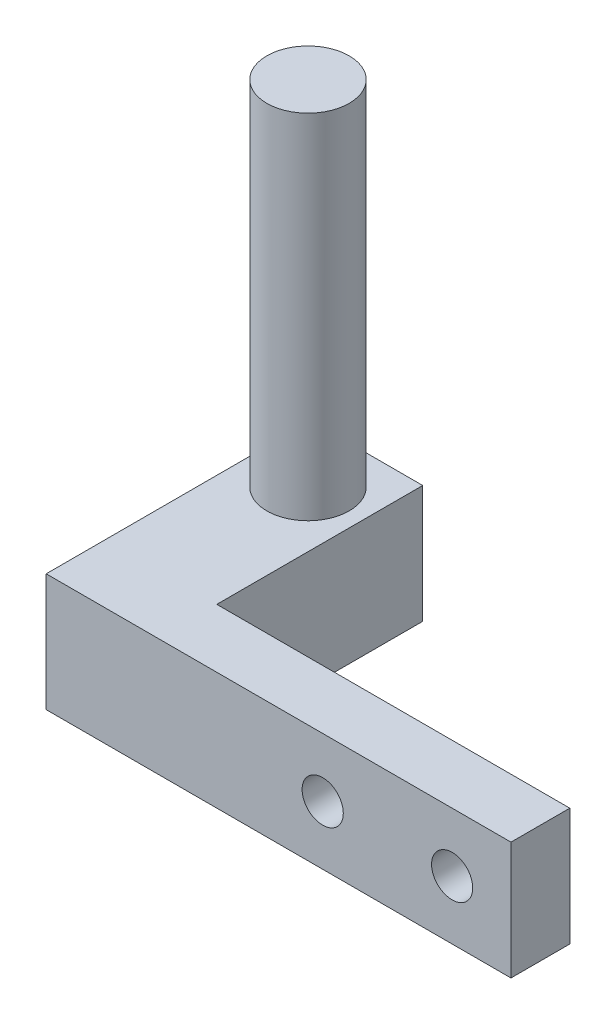
ISO-10303-21;
HEADER;
FILE_DESCRIPTION(('STEP AP214'),'2;1');
FILE_NAME('part.step','',(''),(''),'','','');
FILE_SCHEMA(('AUTOMOTIVE_DESIGN { 1 0 10303 214 1 1 1 1 }'));
ENDSEC;
DATA;
#1=APPLICATION_CONTEXT('core data for automotive mechanical design processes');
#2=APPLICATION_PROTOCOL_DEFINITION('international standard','automotive_design',2000,#1);
#3=PRODUCT_CONTEXT('',#1,'mechanical');
#4=PRODUCT('Part','Part','',(#3));
#5=PRODUCT_RELATED_PRODUCT_CATEGORY('part','',(#4));
#6=PRODUCT_DEFINITION_FORMATION('','',#4);
#7=PRODUCT_DEFINITION_CONTEXT('part definition',#1,'design');
#8=PRODUCT_DEFINITION('design','',#6,#7);
#9=PRODUCT_DEFINITION_SHAPE('','',#8);
#10=(LENGTH_UNIT() NAMED_UNIT(*) SI_UNIT(.MILLI.,.METRE.));
#11=(NAMED_UNIT(*) PLANE_ANGLE_UNIT() SI_UNIT($,.RADIAN.));
#12=(NAMED_UNIT(*) SI_UNIT($,.STERADIAN.) SOLID_ANGLE_UNIT());
#13=UNCERTAINTY_MEASURE_WITH_UNIT(LENGTH_MEASURE(1.E-05),#10,'distance_accuracy_value','');
#14=(GEOMETRIC_REPRESENTATION_CONTEXT(3) GLOBAL_UNCERTAINTY_ASSIGNED_CONTEXT((#13)) GLOBAL_UNIT_ASSIGNED_CONTEXT((#10,
#11,#12)) REPRESENTATION_CONTEXT('',''));
#15=CARTESIAN_POINT('',(0.,0.,0.));
#16=DIRECTION('',(0.,0.,1.));
#17=DIRECTION('',(1.,0.,0.));
#18=AXIS2_PLACEMENT_3D('',#15,#16,#17);
#19=CARTESIAN_POINT('',(8.5,0.,0.));
#20=DIRECTION('',(-1.,0.,0.));
#21=DIRECTION('',(0.,0.,1.));
#22=AXIS2_PLACEMENT_3D('',#19,#20,#21);
#23=PLANE('',#22);
#24=DIRECTION('',(0.,1.,0.));
#25=VECTOR('',#24,1.);
#26=CARTESIAN_POINT('',(8.5,0.,17.5));
#27=LINE('',#26,#25);
#28=CARTESIAN_POINT('',(8.5,0.,17.5));
#29=VERTEX_POINT('',#28);
#30=CARTESIAN_POINT('',(8.5,10.,17.5));
#31=VERTEX_POINT('',#30);
#32=EDGE_CURVE('E51',#29,#31,#27,.T.);
#33=ORIENTED_EDGE('',*,*,#32,.F.);
#34=DIRECTION('',(0.,0.,1.));
#35=VECTOR('',#34,1.);
#36=CARTESIAN_POINT('',(8.5,0.,0.));
#37=LINE('',#36,#35);
#38=CARTESIAN_POINT('',(8.5,0.,0.));
#39=VERTEX_POINT('',#38);
#40=EDGE_CURVE('E135',#39,#29,#37,.T.);
#41=ORIENTED_EDGE('',*,*,#40,.F.);
#42=DIRECTION('',(0.,1.,0.));
#43=VECTOR('',#42,1.);
#44=CARTESIAN_POINT('',(8.5,0.,0.));
#45=LINE('',#44,#43);
#46=CARTESIAN_POINT('',(8.5,10.,0.));
#47=VERTEX_POINT('',#46);
#48=EDGE_CURVE('E137',#39,#47,#45,.T.);
#49=ORIENTED_EDGE('',*,*,#48,.T.);
#50=DIRECTION('',(0.,0.,1.));
#51=VECTOR('',#50,1.);
#52=CARTESIAN_POINT('',(8.5,10.,0.));
#53=LINE('',#52,#51);
#54=EDGE_CURVE('E134',#47,#31,#53,.T.);
#55=ORIENTED_EDGE('',*,*,#54,.T.);
#56=EDGE_LOOP('',(#33,#41,#49,#55));
#57=FACE_BOUND('',#56,.T.);
#58=ADVANCED_FACE('F34',(#57),#23,.F.);
#59=CARTESIAN_POINT('',(0.,0.,10.));
#60=DIRECTION('',(0.,1.,0.));
#61=DIRECTION('',(0.,0.,1.));
#62=AXIS2_PLACEMENT_3D('',#59,#60,#61);
#63=PLANE('',#62);
#64=ORIENTED_EDGE('',*,*,#40,.T.);
#65=DIRECTION('',(-1.,0.,0.));
#66=VECTOR('',#65,1.);
#67=CARTESIAN_POINT('',(38.5,0.,17.5));
#68=LINE('',#67,#66);
#69=CARTESIAN_POINT('',(38.5,0.,17.5));
#70=VERTEX_POINT('',#69);
#71=EDGE_CURVE('E104',#70,#29,#68,.T.);
#72=ORIENTED_EDGE('',*,*,#71,.F.);
#73=DIRECTION('',(0.,0.,-1.));
#74=VECTOR('',#73,1.);
#75=CARTESIAN_POINT('',(38.5,0.,22.5));
#76=LINE('',#75,#74);
#77=CARTESIAN_POINT('',(38.5,0.,22.5));
#78=VERTEX_POINT('',#77);
#79=EDGE_CURVE('E102',#78,#70,#76,.T.);
#80=ORIENTED_EDGE('',*,*,#79,.F.);
#81=DIRECTION('',(1.,0.,0.));
#82=VECTOR('',#81,1.);
#83=CARTESIAN_POINT('',(8.5,0.,22.5));
#84=LINE('',#83,#82);
#85=CARTESIAN_POINT('',(-1.,0.,22.5));
#86=VERTEX_POINT('',#85);
#87=EDGE_CURVE('E91',#86,#78,#84,.T.);
#88=ORIENTED_EDGE('',*,*,#87,.F.);
#89=DIRECTION('',(0.,0.,-1.));
#90=VECTOR('',#89,1.);
#91=CARTESIAN_POINT('',(-1.,0.,0.));
#92=LINE('',#91,#90);
#93=CARTESIAN_POINT('',(-1.,0.,0.));
#94=VERTEX_POINT('',#93);
#95=EDGE_CURVE('E129',#86,#94,#92,.T.);
#96=ORIENTED_EDGE('',*,*,#95,.T.);
#97=DIRECTION('',(1.,0.,0.));
#98=VECTOR('',#97,1.);
#99=CARTESIAN_POINT('',(0.,0.,0.));
#100=LINE('',#99,#98);
#101=EDGE_CURVE('E143',#94,#39,#100,.T.);
#102=ORIENTED_EDGE('',*,*,#101,.T.);
#103=EDGE_LOOP('',(#64,#72,#80,#88,#96,#102));
#104=FACE_BOUND('',#103,.T.);
#105=ADVANCED_FACE('F36',(#104),#63,.F.);
#106=CARTESIAN_POINT('',(0.,10.,10.));
#107=DIRECTION('',(0.,-1.,0.));
#108=DIRECTION('',(0.,0.,-1.));
#109=AXIS2_PLACEMENT_3D('',#106,#107,#108);
#110=PLANE('',#109);
#111=CARTESIAN_POINT('',(3.75,10.,5.));
#112=DIRECTION('',(0.,-1.,0.));
#113=DIRECTION('',(0.,0.,-1.));
#114=AXIS2_PLACEMENT_3D('',#111,#112,#113);
#115=CIRCLE('',#114,3.5);
#116=CARTESIAN_POINT('',(3.75,10.,1.5));
#117=VERTEX_POINT('',#116);
#118=EDGE_CURVE('E11',#117,#117,#115,.F.);
#119=ORIENTED_EDGE('',*,*,#118,.F.);
#120=EDGE_LOOP('',(#119));
#121=FACE_BOUND('',#120,.T.);
#122=DIRECTION('',(-1.,0.,0.));
#123=VECTOR('',#122,1.);
#124=CARTESIAN_POINT('',(0.,10.,0.));
#125=LINE('',#124,#123);
#126=CARTESIAN_POINT('',(-1.,10.,0.));
#127=VERTEX_POINT('',#126);
#128=EDGE_CURVE('E43',#47,#127,#125,.T.);
#129=ORIENTED_EDGE('',*,*,#128,.T.);
#130=DIRECTION('',(0.,0.,-1.));
#131=VECTOR('',#130,1.);
#132=CARTESIAN_POINT('',(-1.,10.,0.));
#133=LINE('',#132,#131);
#134=CARTESIAN_POINT('',(-1.,10.,22.5));
#135=VERTEX_POINT('',#134);
#136=EDGE_CURVE('E59',#135,#127,#133,.T.);
#137=ORIENTED_EDGE('',*,*,#136,.F.);
#138=DIRECTION('',(-1.,0.,0.));
#139=VECTOR('',#138,1.);
#140=CARTESIAN_POINT('',(8.5,10.,22.5));
#141=LINE('',#140,#139);
#142=CARTESIAN_POINT('',(38.5,10.,22.5));
#143=VERTEX_POINT('',#142);
#144=EDGE_CURVE('E126',#143,#135,#141,.T.);
#145=ORIENTED_EDGE('',*,*,#144,.F.);
#146=DIRECTION('',(0.,0.,1.));
#147=VECTOR('',#146,1.);
#148=CARTESIAN_POINT('',(38.5,10.,22.5));
#149=LINE('',#148,#147);
#150=CARTESIAN_POINT('',(38.5,10.,17.5));
#151=VERTEX_POINT('',#150);
#152=EDGE_CURVE('E112',#151,#143,#149,.T.);
#153=ORIENTED_EDGE('',*,*,#152,.F.);
#154=DIRECTION('',(-1.,0.,0.));
#155=VECTOR('',#154,1.);
#156=CARTESIAN_POINT('',(38.5,10.,17.5));
#157=LINE('',#156,#155);
#158=EDGE_CURVE('E121',#151,#31,#157,.T.);
#159=ORIENTED_EDGE('',*,*,#158,.T.);
#160=ORIENTED_EDGE('',*,*,#54,.F.);
#161=EDGE_LOOP('',(#129,#137,#145,#153,#159,#160));
#162=FACE_BOUND('',#161,.T.);
#163=ADVANCED_FACE('F179',(#121,#162),#110,.F.);
#164=CARTESIAN_POINT('',(0.,0.,0.));
#165=DIRECTION('',(0.,0.,-1.));
#166=DIRECTION('',(-1.,0.,0.));
#167=AXIS2_PLACEMENT_3D('',#164,#165,#166);
#168=PLANE('',#167);
#169=DIRECTION('',(0.,1.,0.));
#170=VECTOR('',#169,1.);
#171=CARTESIAN_POINT('',(-1.,0.,0.));
#172=LINE('',#171,#170);
#173=EDGE_CURVE('E131',#94,#127,#172,.T.);
#174=ORIENTED_EDGE('',*,*,#173,.T.);
#175=ORIENTED_EDGE('',*,*,#128,.F.);
#176=ORIENTED_EDGE('',*,*,#48,.F.);
#177=ORIENTED_EDGE('',*,*,#101,.F.);
#178=EDGE_LOOP('',(#174,#175,#176,#177));
#179=FACE_BOUND('',#178,.T.);
#180=ADVANCED_FACE('F187',(#179),#168,.T.);
#181=CARTESIAN_POINT('',(3.75,40.,5.));
#182=DIRECTION('',(0.,-1.,0.));
#183=DIRECTION('',(0.,0.,-1.));
#184=AXIS2_PLACEMENT_3D('',#181,#182,#183);
#185=CYLINDRICAL_SURFACE('',#184,3.5);
#186=CARTESIAN_POINT('',(3.75,40.,5.));
#187=DIRECTION('',(0.,1.,0.));
#188=DIRECTION('',(0.,0.,1.));
#189=AXIS2_PLACEMENT_3D('',#186,#187,#188);
#190=CIRCLE('',#189,3.5);
#191=CARTESIAN_POINT('',(3.75,40.,8.5));
#192=VERTEX_POINT('',#191);
#193=EDGE_CURVE('E140',#192,#192,#190,.T.);
#194=ORIENTED_EDGE('',*,*,#193,.F.);
#195=EDGE_LOOP('',(#194));
#196=FACE_BOUND('',#195,.T.);
#197=ORIENTED_EDGE('',*,*,#118,.T.);
#198=EDGE_LOOP('',(#197));
#199=FACE_BOUND('',#198,.T.);
#200=ADVANCED_FACE('F183',(#196,#199),#185,.T.);
#201=CARTESIAN_POINT('',(3.75,40.,5.));
#202=DIRECTION('',(0.,1.,0.));
#203=DIRECTION('',(0.,0.,1.));
#204=AXIS2_PLACEMENT_3D('',#201,#202,#203);
#205=PLANE('',#204);
#206=ORIENTED_EDGE('',*,*,#193,.T.);
#207=EDGE_LOOP('',(#206));
#208=FACE_BOUND('',#207,.T.);
#209=ADVANCED_FACE('F172',(#208),#205,.T.);
#210=CARTESIAN_POINT('',(-1.,0.,0.));
#211=DIRECTION('',(1.,0.,0.));
#212=DIRECTION('',(0.,0.,-1.));
#213=AXIS2_PLACEMENT_3D('',#210,#211,#212);
#214=PLANE('',#213);
#215=ORIENTED_EDGE('',*,*,#136,.T.);
#216=ORIENTED_EDGE('',*,*,#173,.F.);
#217=ORIENTED_EDGE('',*,*,#95,.F.);
#218=DIRECTION('',(0.,-1.,0.));
#219=VECTOR('',#218,1.);
#220=CARTESIAN_POINT('',(-1.,0.,22.5));
#221=LINE('',#220,#219);
#222=EDGE_CURVE('E97',#135,#86,#221,.T.);
#223=ORIENTED_EDGE('',*,*,#222,.F.);
#224=EDGE_LOOP('',(#215,#216,#217,#223));
#225=FACE_BOUND('',#224,.T.);
#226=ADVANCED_FACE('F165',(#225),#214,.F.);
#227=CARTESIAN_POINT('',(0.,0.,22.5));
#228=DIRECTION('',(0.,0.,1.));
#229=DIRECTION('',(1.,0.,0.));
#230=AXIS2_PLACEMENT_3D('',#227,#228,#229);
#231=PLANE('',#230);
#232=CARTESIAN_POINT('',(33.5,5.,22.5));
#233=DIRECTION('',(0.,0.,1.));
#234=DIRECTION('',(1.,0.,0.));
#235=AXIS2_PLACEMENT_3D('',#232,#233,#234);
#236=CIRCLE('',#235,1.75);
#237=CARTESIAN_POINT('',(35.25,5.,22.5));
#238=VERTEX_POINT('',#237);
#239=EDGE_CURVE('E153',#238,#238,#236,.T.);
#240=ORIENTED_EDGE('',*,*,#239,.F.);
#241=EDGE_LOOP('',(#240));
#242=FACE_BOUND('',#241,.T.);
#243=CARTESIAN_POINT('',(22.5,5.,22.5));
#244=DIRECTION('',(0.,0.,1.));
#245=DIRECTION('',(1.,0.,0.));
#246=AXIS2_PLACEMENT_3D('',#243,#244,#245);
#247=CIRCLE('',#246,1.75);
#248=CARTESIAN_POINT('',(24.25,5.,22.5));
#249=VERTEX_POINT('',#248);
#250=EDGE_CURVE('E117',#249,#249,#247,.T.);
#251=ORIENTED_EDGE('',*,*,#250,.F.);
#252=EDGE_LOOP('',(#251));
#253=FACE_BOUND('',#252,.T.);
#254=ORIENTED_EDGE('',*,*,#87,.T.);
#255=DIRECTION('',(0.,-1.,0.));
#256=VECTOR('',#255,1.);
#257=CARTESIAN_POINT('',(38.5,0.,22.5));
#258=LINE('',#257,#256);
#259=EDGE_CURVE('E96',#143,#78,#258,.T.);
#260=ORIENTED_EDGE('',*,*,#259,.F.);
#261=ORIENTED_EDGE('',*,*,#144,.T.);
#262=ORIENTED_EDGE('',*,*,#222,.T.);
#263=EDGE_LOOP('',(#254,#260,#261,#262));
#264=FACE_BOUND('',#263,.T.);
#265=ADVANCED_FACE('F93',(#242,#253,#264),#231,.T.);
#266=CARTESIAN_POINT('',(38.5,0.,17.5));
#267=DIRECTION('',(0.,0.,1.));
#268=DIRECTION('',(1.,0.,0.));
#269=AXIS2_PLACEMENT_3D('',#266,#267,#268);
#270=PLANE('',#269);
#271=CARTESIAN_POINT('',(33.5,5.,17.5));
#272=DIRECTION('',(0.,0.,1.));
#273=DIRECTION('',(1.,0.,0.));
#274=AXIS2_PLACEMENT_3D('',#271,#272,#273);
#275=CIRCLE('',#274,1.75);
#276=CARTESIAN_POINT('',(35.25,5.,17.5));
#277=VERTEX_POINT('',#276);
#278=EDGE_CURVE('E38',#277,#277,#275,.T.);
#279=ORIENTED_EDGE('',*,*,#278,.T.);
#280=EDGE_LOOP('',(#279));
#281=FACE_BOUND('',#280,.T.);
#282=CARTESIAN_POINT('',(22.5,5.,17.5));
#283=DIRECTION('',(0.,0.,1.));
#284=DIRECTION('',(1.,0.,0.));
#285=AXIS2_PLACEMENT_3D('',#282,#283,#284);
#286=CIRCLE('',#285,1.75);
#287=CARTESIAN_POINT('',(24.25,5.,17.5));
#288=VERTEX_POINT('',#287);
#289=EDGE_CURVE('E114',#288,#288,#286,.T.);
#290=ORIENTED_EDGE('',*,*,#289,.T.);
#291=EDGE_LOOP('',(#290));
#292=FACE_BOUND('',#291,.T.);
#293=ORIENTED_EDGE('',*,*,#32,.T.);
#294=ORIENTED_EDGE('',*,*,#158,.F.);
#295=DIRECTION('',(0.,1.,0.));
#296=VECTOR('',#295,1.);
#297=CARTESIAN_POINT('',(38.5,0.,17.5));
#298=LINE('',#297,#296);
#299=EDGE_CURVE('E107',#70,#151,#298,.T.);
#300=ORIENTED_EDGE('',*,*,#299,.F.);
#301=ORIENTED_EDGE('',*,*,#71,.T.);
#302=EDGE_LOOP('',(#293,#294,#300,#301));
#303=FACE_BOUND('',#302,.T.);
#304=ADVANCED_FACE('F164',(#281,#292,#303),#270,.F.);
#305=CARTESIAN_POINT('',(38.5,0.,0.));
#306=DIRECTION('',(-1.,0.,0.));
#307=DIRECTION('',(0.,0.,1.));
#308=AXIS2_PLACEMENT_3D('',#305,#306,#307);
#309=PLANE('',#308);
#310=ORIENTED_EDGE('',*,*,#259,.T.);
#311=ORIENTED_EDGE('',*,*,#79,.T.);
#312=ORIENTED_EDGE('',*,*,#299,.T.);
#313=ORIENTED_EDGE('',*,*,#152,.T.);
#314=EDGE_LOOP('',(#310,#311,#312,#313));
#315=FACE_BOUND('',#314,.T.);
#316=ADVANCED_FACE('F110',(#315),#309,.F.);
#317=CARTESIAN_POINT('',(22.5,5.,0.));
#318=DIRECTION('',(0.,0.,1.));
#319=DIRECTION('',(1.,0.,0.));
#320=AXIS2_PLACEMENT_3D('',#317,#318,#319);
#321=CYLINDRICAL_SURFACE('',#320,1.75);
#322=ORIENTED_EDGE('',*,*,#250,.T.);
#323=EDGE_LOOP('',(#322));
#324=FACE_BOUND('',#323,.T.);
#325=ORIENTED_EDGE('',*,*,#289,.F.);
#326=EDGE_LOOP('',(#325));
#327=FACE_BOUND('',#326,.T.);
#328=ADVANCED_FACE('F265',(#324,#327),#321,.F.);
#329=CARTESIAN_POINT('',(33.5,5.,0.));
#330=DIRECTION('',(0.,0.,1.));
#331=DIRECTION('',(1.,0.,0.));
#332=AXIS2_PLACEMENT_3D('',#329,#330,#331);
#333=CYLINDRICAL_SURFACE('',#332,1.75);
#334=ORIENTED_EDGE('',*,*,#239,.T.);
#335=EDGE_LOOP('',(#334));
#336=FACE_BOUND('',#335,.T.);
#337=ORIENTED_EDGE('',*,*,#278,.F.);
#338=EDGE_LOOP('',(#337));
#339=FACE_BOUND('',#338,.T.);
#340=ADVANCED_FACE('F159',(#336,#339),#333,.F.);
#341=CLOSED_SHELL('',(#58,#105,#163,#180,#200,#209,#226,#265,#304,#316,#328,#340));
#342=MANIFOLD_SOLID_BREP('B2',#341);
#343=ADVANCED_BREP_SHAPE_REPRESENTATION('',(#18,#342),#14);
#344=SHAPE_DEFINITION_REPRESENTATION(#9,#343);
ENDSEC;
END-ISO-10303-21;
